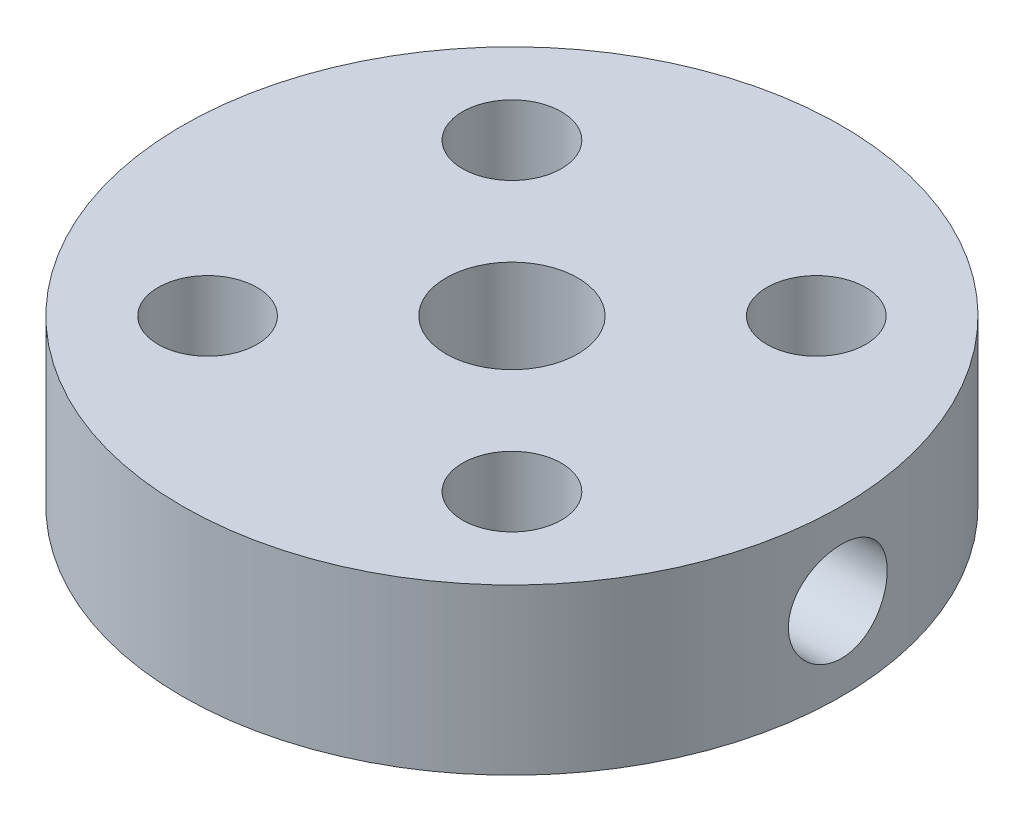
ISO-10303-21;
HEADER;
FILE_DESCRIPTION(('STEP AP214'),'2;1');
FILE_NAME('part.step','',(''),(''),'','','');
FILE_SCHEMA(('AUTOMOTIVE_DESIGN { 1 0 10303 214 1 1 1 1 }'));
ENDSEC;
DATA;
#1=APPLICATION_CONTEXT('core data for automotive mechanical design processes');
#2=APPLICATION_PROTOCOL_DEFINITION('international standard','automotive_design',2000,#1);
#3=PRODUCT_CONTEXT('',#1,'mechanical');
#4=PRODUCT('Part','Part','',(#3));
#5=PRODUCT_RELATED_PRODUCT_CATEGORY('part','',(#4));
#6=PRODUCT_DEFINITION_FORMATION('','',#4);
#7=PRODUCT_DEFINITION_CONTEXT('part definition',#1,'design');
#8=PRODUCT_DEFINITION('design','',#6,#7);
#9=PRODUCT_DEFINITION_SHAPE('','',#8);
#10=(LENGTH_UNIT() NAMED_UNIT(*) SI_UNIT(.MILLI.,.METRE.));
#11=(NAMED_UNIT(*) PLANE_ANGLE_UNIT() SI_UNIT($,.RADIAN.));
#12=(NAMED_UNIT(*) SI_UNIT($,.STERADIAN.) SOLID_ANGLE_UNIT());
#13=UNCERTAINTY_MEASURE_WITH_UNIT(LENGTH_MEASURE(1.E-05),#10,'distance_accuracy_value','');
#14=(GEOMETRIC_REPRESENTATION_CONTEXT(3) GLOBAL_UNCERTAINTY_ASSIGNED_CONTEXT((#13)) GLOBAL_UNIT_ASSIGNED_CONTEXT((#10,
#11,#12)) REPRESENTATION_CONTEXT('',''));
#15=CARTESIAN_POINT('',(0.,0.,0.));
#16=DIRECTION('',(0.,0.,1.));
#17=DIRECTION('',(1.,0.,0.));
#18=AXIS2_PLACEMENT_3D('',#15,#16,#17);
#19=CARTESIAN_POINT('',(-4.61740728114789,5.,4.61740728114842));
#20=DIRECTION('',(0.,-1.,0.));
#21=DIRECTION('',(0.,0.,-1.));
#22=AXIS2_PLACEMENT_3D('',#19,#20,#21);
#23=CYLINDRICAL_SURFACE('',#22,1.50000000000019);
#24=CARTESIAN_POINT('',(-4.61740728114789,5.,4.61740728114842));
#25=DIRECTION('',(0.,1.,0.));
#26=DIRECTION('',(0.,0.,1.));
#27=AXIS2_PLACEMENT_3D('',#24,#25,#26);
#28=CIRCLE('',#27,1.50000000000019);
#29=CARTESIAN_POINT('',(-4.61740728114789,5.,6.11740728114861));
#30=VERTEX_POINT('',#29);
#31=EDGE_CURVE('E52',#30,#30,#28,.T.);
#32=ORIENTED_EDGE('',*,*,#31,.T.);
#33=EDGE_LOOP('',(#32));
#34=FACE_BOUND('',#33,.T.);
#35=CARTESIAN_POINT('',(-4.61740728114789,0.,4.61740728114842));
#36=DIRECTION('',(0.,1.,0.));
#37=DIRECTION('',(0.,0.,1.));
#38=AXIS2_PLACEMENT_3D('',#35,#36,#37);
#39=CIRCLE('',#38,1.50000000000019);
#40=CARTESIAN_POINT('',(-4.61740728114789,0.,6.11740728114861));
#41=VERTEX_POINT('',#40);
#42=EDGE_CURVE('E74',#41,#41,#39,.T.);
#43=ORIENTED_EDGE('',*,*,#42,.F.);
#44=EDGE_LOOP('',(#43));
#45=FACE_BOUND('',#44,.T.);
#46=ADVANCED_FACE('F36',(#34,#45),#23,.F.);
#47=CARTESIAN_POINT('',(-4.61740728114816,5.,-4.61740728114789));
#48=DIRECTION('',(0.,-1.,0.));
#49=DIRECTION('',(0.,0.,-1.));
#50=AXIS2_PLACEMENT_3D('',#47,#48,#49);
#51=CYLINDRICAL_SURFACE('',#50,1.50000000000028);
#52=CARTESIAN_POINT('',(-4.61740728114816,5.,-4.61740728114789));
#53=DIRECTION('',(0.,1.,0.));
#54=DIRECTION('',(0.,0.,1.));
#55=AXIS2_PLACEMENT_3D('',#52,#53,#54);
#56=CIRCLE('',#55,1.50000000000028);
#57=CARTESIAN_POINT('',(-4.61740728114816,5.,-3.11740728114761));
#58=VERTEX_POINT('',#57);
#59=EDGE_CURVE('E57',#58,#58,#56,.T.);
#60=ORIENTED_EDGE('',*,*,#59,.T.);
#61=EDGE_LOOP('',(#60));
#62=FACE_BOUND('',#61,.T.);
#63=CARTESIAN_POINT('',(-4.61740728114816,0.,-4.61740728114789));
#64=DIRECTION('',(0.,1.,0.));
#65=DIRECTION('',(0.,0.,1.));
#66=AXIS2_PLACEMENT_3D('',#63,#64,#65);
#67=CIRCLE('',#66,1.50000000000028);
#68=CARTESIAN_POINT('',(-4.61740728114816,0.,-3.11740728114761));
#69=VERTEX_POINT('',#68);
#70=EDGE_CURVE('E71',#69,#69,#67,.T.);
#71=ORIENTED_EDGE('',*,*,#70,.F.);
#72=EDGE_LOOP('',(#71));
#73=FACE_BOUND('',#72,.T.);
#74=ADVANCED_FACE('F99',(#62,#73),#51,.F.);
#75=CARTESIAN_POINT('',(0.,5.,0.));
#76=DIRECTION('',(0.,-1.,0.));
#77=DIRECTION('',(0.,0.,-1.));
#78=AXIS2_PLACEMENT_3D('',#75,#76,#77);
#79=CYLINDRICAL_SURFACE('',#78,2.);
#80=CARTESIAN_POINT('',(1.32287565553229,2.5,-1.5));
#81=CARTESIAN_POINT('',(1.32289190044095,2.43000257657437,-1.49999219049448));
#82=CARTESIAN_POINT('',(1.32856366615416,2.35995416568808,-1.4950410907442));
#83=CARTESIAN_POINT('',(1.34990644032801,2.22267014379052,-1.47578333210409));
#84=CARTESIAN_POINT('',(1.3656072516867,2.15544355498049,-1.46144878565587));
#85=CARTESIAN_POINT('',(1.4037512791687,2.02642015326162,-1.42483838991846));
#86=CARTESIAN_POINT('',(1.42609848244814,1.96456122323754,-1.40267483444956));
#87=CARTESIAN_POINT('',(1.47486455031267,1.84565454555481,-1.35130655299364));
#88=CARTESIAN_POINT('',(1.50128292264932,1.78860621753078,-1.32210267801691));
#89=CARTESIAN_POINT('',(1.56177312961147,1.66788720368341,-1.25039909811055));
#90=CARTESIAN_POINT('',(1.59628904009787,1.60533206577352,-1.20639573950363));
#91=CARTESIAN_POINT('',(1.66521164096378,1.48747453375773,-1.10933596759308));
#92=CARTESIAN_POINT('',(1.69961809339876,1.43218303517973,-1.05626622282799));
#93=CARTESIAN_POINT('',(1.77262582436251,1.31914126134453,-0.929610192252516));
#94=CARTESIAN_POINT('',(1.81064921229758,1.26319403328014,-0.854047289142165));
#95=CARTESIAN_POINT('',(1.87882809751632,1.16537779171716,-0.691189714821942));
#96=CARTESIAN_POINT('',(1.90900204180106,1.12347570253119,-0.603923293836168));
#97=CARTESIAN_POINT('',(1.95034258990248,1.06679231409706,-0.447869023983647));
#98=CARTESIAN_POINT('',(1.96449710921006,1.04764290402153,-0.381446049692538));
#99=CARTESIAN_POINT('',(1.98605635937555,1.01860988400325,-0.245552609316544));
#100=CARTESIAN_POINT('',(1.99346695432364,1.00871822389326,-0.176084845995171));
#101=CARTESIAN_POINT('',(2.00091375578087,0.998778266137508,-0.0358650926220291));
#102=CARTESIAN_POINT('',(2.00093080057495,0.998755545623561,0.0348897591186376));
#103=CARTESIAN_POINT('',(1.99354206503066,1.00861793678029,0.175316156674035));
#104=CARTESIAN_POINT('',(1.98613456571337,1.01850534290814,0.244987447822225));
#105=CARTESIAN_POINT('',(1.96491377944411,1.04708105058987,0.37888919379265));
#106=CARTESIAN_POINT('',(1.9513285776568,1.06545632638708,0.443224268236294));
#107=CARTESIAN_POINT('',(1.91882278657017,1.10999564218224,0.567680485046395));
#108=CARTESIAN_POINT('',(1.89990103394193,1.13616138051316,0.627800705033634));
#109=CARTESIAN_POINT('',(1.85561045984504,1.19852961514532,0.749216921864728));
#110=CARTESIAN_POINT('',(1.82976540608097,1.23551209661876,0.809935384713597));
#111=CARTESIAN_POINT('',(1.77460702483739,1.31673370397051,0.924567250548282));
#112=CARTESIAN_POINT('',(1.74529074780454,1.3609790136999,0.978474784621219));
#113=CARTESIAN_POINT('',(1.6789376587236,1.46522334882094,1.08908204283329));
#114=CARTESIAN_POINT('',(1.64151655866368,1.5266092100264,1.14424493004784));
#115=CARTESIAN_POINT('',(1.5672595828377,1.65783458362194,1.24400875556228));
#116=CARTESIAN_POINT('',(1.53042399363524,1.72767809952506,1.28860466211477));
#117=CARTESIAN_POINT('',(1.46819425999159,1.86098187024563,1.358732064116));
#118=CARTESIAN_POINT('',(1.44197599789983,1.92298704530065,1.38628866868102));
#119=CARTESIAN_POINT('',(1.39536741257394,2.05206528141938,1.43319397108784));
#120=CARTESIAN_POINT('',(1.37496395320511,2.11912647969037,1.45256121808259));
#121=CARTESIAN_POINT('',(1.34640050620232,2.24368694399832,1.47902385350669));
#122=CARTESIAN_POINT('',(1.3366153955687,2.30044708211686,1.48779069496581));
#123=CARTESIAN_POINT('',(1.32435588438334,2.41535546617383,1.49871760619789));
#124=CARTESIAN_POINT('',(1.32187213058308,2.47350183990282,1.50088612873265));
#125=CARTESIAN_POINT('',(1.32462868790497,2.5894789917334,1.49845270115551));
#126=CARTESIAN_POINT('',(1.32987184207164,2.64730964580967,1.4938482589949));
#127=CARTESIAN_POINT('',(1.34721218775046,2.76107615244287,1.47822527271969));
#128=CARTESIAN_POINT('',(1.35932107727345,2.8170085979481,1.46719578056394));
#129=CARTESIAN_POINT('',(1.39427758287802,2.94633804493887,1.43413959562387));
#130=CARTESIAN_POINT('',(1.41944823697315,3.01843595391503,1.40954189769242));
#131=CARTESIAN_POINT('',(1.47537861079976,3.15630766364012,1.35088877838435));
#132=CARTESIAN_POINT('',(1.5061485847723,3.22206951729475,1.31681594335476));
#133=CARTESIAN_POINT('',(1.5710828237565,3.34934900804812,1.23869774116696));
#134=CARTESIAN_POINT('',(1.60532883846046,3.41063287621826,1.19434110060341));
#135=CARTESIAN_POINT('',(1.67347506272361,3.52600209636125,1.09682562914592));
#136=CARTESIAN_POINT('',(1.70737509574665,3.58008392798894,1.04366252194463));
#137=CARTESIAN_POINT('',(1.77960222623533,3.69127699162937,0.916234513829617));
#138=CARTESIAN_POINT('',(1.81728174165357,3.7464752388576,0.839896270946852));
#139=CARTESIAN_POINT('',(1.88453104769826,3.84262073345087,0.675551612651262));
#140=CARTESIAN_POINT('',(1.91411836052284,3.88359882458129,0.587571029974846));
#141=CARTESIAN_POINT('',(1.9541940640238,3.93843799144687,0.430755661496905));
#142=CARTESIAN_POINT('',(1.9677547802964,3.95675679327544,0.364250057327467));
#143=CARTESIAN_POINT('',(1.98810265589123,3.98412879630752,0.228364464964346));
#144=CARTESIAN_POINT('',(1.9948958710696,3.99319028154851,0.158987104561937));
#145=CARTESIAN_POINT('',(2.00113566717062,4.0015163909286,0.0191476059403936));
#146=CARTESIAN_POINT('',(2.00056500218907,4.00075801734824,-0.0513166925870926));
#147=CARTESIAN_POINT('',(1.9920880324381,3.98943900869876,-0.191009011030086));
#148=CARTESIAN_POINT('',(1.98417977344351,3.97887576229252,-0.260236696591293));
#149=CARTESIAN_POINT('',(1.96203400925195,3.94902508383276,-0.393521935254976));
#150=CARTESIAN_POINT('',(1.94798690792879,3.92999981867845,-0.457671236511446));
#151=CARTESIAN_POINT('',(1.91462720575136,3.88421193438106,-0.581661343097393));
#152=CARTESIAN_POINT('',(1.89531347862386,3.85744766016908,-0.641501223388819));
#153=CARTESIAN_POINT('',(1.8501764221064,3.79372206240403,-0.762547698766817));
#154=CARTESIAN_POINT('',(1.82386352707581,3.75594906864041,-0.823141236713423));
#155=CARTESIAN_POINT('',(1.76785506075716,3.67313355944579,-0.937414811724219));
#156=CARTESIAN_POINT('',(1.73815638795658,3.62808436271395,-0.991088412383378));
#157=CARTESIAN_POINT('',(1.67106353042106,3.5219946334392,-1.10112380660682));
#158=CARTESIAN_POINT('',(1.63330922504697,3.45955360056009,-1.15591691541996));
#159=CARTESIAN_POINT('',(1.55866082463332,3.32613192810012,-1.25475253429351));
#160=CARTESIAN_POINT('',(1.52176704921891,3.25514817396343,-1.29879110556729));
#161=CARTESIAN_POINT('',(1.46049601449284,3.12111674940969,-1.36695971301455));
#162=CARTESIAN_POINT('',(1.43513625007636,3.05966501729344,-1.39333526337999));
#163=CARTESIAN_POINT('',(1.39032564651232,2.93191708694412,-1.438053980286));
#164=CARTESIAN_POINT('',(1.37085915899696,2.86563430840454,-1.45641847678344));
#165=CARTESIAN_POINT('',(1.34532423383262,2.74921178040307,-1.47997057756381));
#166=CARTESIAN_POINT('',(1.33700130265679,2.70003292870953,-1.48744249026867));
#167=CARTESIAN_POINT('',(1.32577295392454,2.60057766696634,-1.49745839072448));
#168=CARTESIAN_POINT('',(1.32286398151145,2.55030199905627,-1.50000561211714));
#169=CARTESIAN_POINT('',(1.32287565553229,2.5,-1.5));
#170=B_SPLINE_CURVE_WITH_KNOTS('',3,(#80,#81,#82,#83,#84,#85,#86,#87,#88,#89,#90,#91,#92,#93,
#94,#95,#96,#97,#98,#99,#100,#101,#102,#103,#104,#105,#106,#107,#108,#109,#110,#111,#112,#113,
#114,#115,#116,#117,#118,#119,#120,#121,#122,#123,#124,#125,#126,#127,#128,#129,#130,#131,#132,
#133,#134,#135,#136,#137,#138,#139,#140,#141,#142,#143,#144,#145,#146,#147,#148,#149,#150,#151,
#152,#153,#154,#155,#156,#157,#158,#159,#160,#161,#162,#163,#164,#165,#166,#167,#168,#169),
.UNSPECIFIED.,.T.,.F.,(4,2,2,2,2,2,2,2,2,2,2,2,2,2,2,2,2,2,2,2,2,2,2,2,2,2,2,2,2,2,2,2,2,2,2,2,
2,2,2,2,2,2,2,2,4),(0.,0.20973177668449,0.420089722582994,0.627545385620138,0.834975984672344,
1.08585208691169,1.33710031031849,1.63964848103538,1.94147907444963,2.15227725277555,
2.36289195870711,2.57405250727807,2.78526195641288,2.9892375589505,3.19325766108669,
3.41936844116895,3.64567274887663,3.91649517204702,4.18744629647933,4.40499409477197,
4.62204646613006,4.79608005545901,4.96989060538193,5.14376512326213,5.31793678696019,
5.55730028202398,5.79710662639151,6.0454320909006,6.29387849446618,6.59652499511463,
6.89851088586565,7.10852896194427,7.31835893539181,7.52868041101044,7.73905791773945,
7.94332812691912,8.14764205379333,8.3751005248961,8.60276905744645,8.87547580578155,
9.14828228208531,9.36218279640836,9.57551025772699,9.72632812073766,9.87704692032409),.UNSPECIFIED.);
#171=CARTESIAN_POINT('',(1.32287565553229,2.5,-1.5));
#172=VERTEX_POINT('',#171);
#173=EDGE_CURVE('E65',#172,#172,#170,.T.);
#174=ORIENTED_EDGE('',*,*,#173,.F.);
#175=EDGE_LOOP('',(#174));
#176=FACE_BOUND('',#175,.T.);
#177=CARTESIAN_POINT('',(0.,5.,0.));
#178=DIRECTION('',(0.,1.,0.));
#179=DIRECTION('',(0.,0.,1.));
#180=AXIS2_PLACEMENT_3D('',#177,#178,#179);
#181=CIRCLE('',#180,2.);
#182=CARTESIAN_POINT('',(0.,5.,2.));
#183=VERTEX_POINT('',#182);
#184=EDGE_CURVE('E87',#183,#183,#181,.T.);
#185=ORIENTED_EDGE('',*,*,#184,.T.);
#186=EDGE_LOOP('',(#185));
#187=FACE_BOUND('',#186,.T.);
#188=CARTESIAN_POINT('',(0.,0.,0.));
#189=DIRECTION('',(0.,1.,0.));
#190=DIRECTION('',(0.,0.,1.));
#191=AXIS2_PLACEMENT_3D('',#188,#189,#190);
#192=CIRCLE('',#191,2.);
#193=CARTESIAN_POINT('',(0.,0.,2.));
#194=VERTEX_POINT('',#193);
#195=EDGE_CURVE('E68',#194,#194,#192,.T.);
#196=ORIENTED_EDGE('',*,*,#195,.F.);
#197=EDGE_LOOP('',(#196));
#198=FACE_BOUND('',#197,.T.);
#199=ADVANCED_FACE('F130',(#176,#187,#198),#79,.F.);
#200=CARTESIAN_POINT('',(4.61740728114815,5.,-4.61740728114816));
#201=DIRECTION('',(0.,-1.,0.));
#202=DIRECTION('',(0.,0.,-1.));
#203=AXIS2_PLACEMENT_3D('',#200,#201,#202);
#204=CYLINDRICAL_SURFACE('',#203,1.5);
#205=CARTESIAN_POINT('',(4.61740728114815,5.,-4.61740728114816));
#206=DIRECTION('',(0.,1.,0.));
#207=DIRECTION('',(0.,0.,1.));
#208=AXIS2_PLACEMENT_3D('',#205,#206,#207);
#209=CIRCLE('',#208,1.5);
#210=CARTESIAN_POINT('',(4.61740728114815,5.,-3.11740728114816));
#211=VERTEX_POINT('',#210);
#212=EDGE_CURVE('E82',#211,#211,#209,.T.);
#213=ORIENTED_EDGE('',*,*,#212,.T.);
#214=EDGE_LOOP('',(#213));
#215=FACE_BOUND('',#214,.T.);
#216=CARTESIAN_POINT('',(4.61740728114815,0.,-4.61740728114816));
#217=DIRECTION('',(0.,1.,0.));
#218=DIRECTION('',(0.,0.,1.));
#219=AXIS2_PLACEMENT_3D('',#216,#217,#218);
#220=CIRCLE('',#219,1.5);
#221=CARTESIAN_POINT('',(4.61740728114815,0.,-3.11740728114816));
#222=VERTEX_POINT('',#221);
#223=EDGE_CURVE('E64',#222,#222,#220,.T.);
#224=ORIENTED_EDGE('',*,*,#223,.F.);
#225=EDGE_LOOP('',(#224));
#226=FACE_BOUND('',#225,.T.);
#227=ADVANCED_FACE('F133',(#215,#226),#204,.F.);
#228=CARTESIAN_POINT('',(0.,5.,0.));
#229=DIRECTION('',(0.,-1.,0.));
#230=DIRECTION('',(0.,0.,-1.));
#231=AXIS2_PLACEMENT_3D('',#228,#229,#230);
#232=CYLINDRICAL_SURFACE('',#231,10.);
#233=CARTESIAN_POINT('',(9.8868599666426,2.5,-1.5));
#234=CARTESIAN_POINT('',(9.88686136668593,2.41625443071005,-1.49999654107284));
#235=CARTESIAN_POINT('',(9.88793551739101,2.33246024924929,-1.49296296388491));
#236=CARTESIAN_POINT('',(9.8921131480324,2.16721468511687,-1.46502196657001));
#237=CARTESIAN_POINT('',(9.8952186073143,2.08576566851999,-1.44410101402628));
#238=CARTESIAN_POINT('',(9.90309938986228,1.9276262445531,-1.38902526098084));
#239=CARTESIAN_POINT('',(9.90787343131536,1.85093223745784,-1.35488061681397));
#240=CARTESIAN_POINT('',(9.91855194113145,1.70437296922792,-1.27435063087792));
#241=CARTESIAN_POINT('',(9.92445625383668,1.6345067697857,-1.22796697429872));
#242=CARTESIAN_POINT('',(9.9367828924804,1.50301618324567,-1.12387902418559));
#243=CARTESIAN_POINT('',(9.94320862458058,1.44145438659326,-1.0660960558482));
#244=CARTESIAN_POINT('',(9.95582368169047,1.3288625143445,-0.941019605444376));
#245=CARTESIAN_POINT('',(9.96201299368615,1.27783301783301,-0.873725600786531));
#246=CARTESIAN_POINT('',(9.97349347428185,1.18752336830864,-0.731136358052747));
#247=CARTESIAN_POINT('',(9.97878018435569,1.14830084967754,-0.655804227365769));
#248=CARTESIAN_POINT('',(9.98782206746405,1.08308840119182,-0.499528850106976));
#249=CARTESIAN_POINT('',(9.99157732141945,1.05709777215711,-0.418585900270679));
#250=CARTESIAN_POINT('',(9.99710914797782,1.01927661146916,-0.254031123090571));
#251=CARTESIAN_POINT('',(9.99890035887344,1.00734127361284,-0.170443884389868));
#252=CARTESIAN_POINT('',(10.0003524476958,0.997644065175104,-0.00243520401948097));
#253=CARTESIAN_POINT('',(10.0000134440494,0.999881406680311,0.0819861910157443));
#254=CARTESIAN_POINT('',(9.99725499660796,1.01838333776243,0.248551718200518));
#255=CARTESIAN_POINT('',(9.99485227652479,1.03453517179148,0.330708691400005));
#256=CARTESIAN_POINT('',(9.98825500227851,1.08023060632258,0.491132829143135));
#257=CARTESIAN_POINT('',(9.98406040199739,1.10977455150144,0.56939989351348));
#258=CARTESIAN_POINT('',(9.97432193873206,1.18153099691709,0.720163780770315));
#259=CARTESIAN_POINT('',(9.96877303515638,1.22379096510874,0.792637672323595));
#260=CARTESIAN_POINT('',(9.95694438245421,1.31974519366999,0.929507907150176));
#261=CARTESIAN_POINT('',(9.95066458523184,1.37344020670687,0.993903718271733));
#262=CARTESIAN_POINT('',(9.93800158192627,1.49136844882659,1.11345448272264));
#263=CARTESIAN_POINT('',(9.93161796623257,1.55570012197011,1.16851232950946));
#264=CARTESIAN_POINT('',(9.91952704453523,1.69274107712373,1.26706599338813));
#265=CARTESIAN_POINT('',(9.91381974269649,1.76545041071992,1.31056173927999));
#266=CARTESIAN_POINT('',(9.90372775286856,1.91728396294064,1.38476964534605));
#267=CARTESIAN_POINT('',(9.89934409845291,1.99641313366239,1.41547182270081));
#268=CARTESIAN_POINT('',(9.8924140289906,2.15878525514739,1.46312336208879));
#269=CARTESIAN_POINT('',(9.88986748446299,2.24202791554675,1.48007369337326));
#270=CARTESIAN_POINT('',(9.88692451395027,2.40940008957749,1.49960720086655));
#271=CARTESIAN_POINT('',(9.88650748802574,2.49351318820153,1.50232803265052));
#272=CARTESIAN_POINT('',(9.88781607937153,2.66099419481734,1.49369057019819));
#273=CARTESIAN_POINT('',(9.88954163015778,2.74436212585076,1.48233271282302));
#274=CARTESIAN_POINT('',(9.89492202461453,2.90755981796563,1.44597702952766));
#275=CARTESIAN_POINT('',(9.89856716482858,2.9874052049416,1.42104778527821));
#276=CARTESIAN_POINT('',(9.90736801825768,3.14178409204861,1.35832831947086));
#277=CARTESIAN_POINT('',(9.91252380607176,3.2163173296282,1.32053746276389));
#278=CARTESIAN_POINT('',(9.92381355687063,3.35857326033504,1.23283677995323));
#279=CARTESIAN_POINT('',(9.92995459279988,3.42624044727982,1.18283784561766));
#280=CARTESIAN_POINT('',(9.94250159433355,3.55227285987381,1.07226416837201));
#281=CARTESIAN_POINT('',(9.94890757490292,3.61063755918115,1.01168882744679));
#282=CARTESIAN_POINT('',(9.96132705217387,3.71690260663358,0.881075619628182));
#283=CARTESIAN_POINT('',(9.96733683460423,3.76471172824248,0.810963126771956));
#284=CARTESIAN_POINT('',(9.97822905032016,3.84787290526264,0.66362208026368));
#285=CARTESIAN_POINT('',(9.98311151444563,3.88322530146503,0.586393721360438));
#286=CARTESIAN_POINT('',(9.99118269660795,3.94032374248803,0.427297995861146));
#287=CARTESIAN_POINT('',(9.99437761717899,3.96211966707836,0.345448858754301));
#288=CARTESIAN_POINT('',(9.99873976656896,3.99164787953747,0.179200815501192));
#289=CARTESIAN_POINT('',(9.99990712930802,3.99938109624914,0.0948020781305798));
#290=CARTESIAN_POINT('',(10.0000812905914,4.0005417045494,-0.0732645908608196));
#291=CARTESIAN_POINT('',(9.99910917023796,3.99410868087698,-0.156931570212053));
#292=CARTESIAN_POINT('',(9.99515610519141,3.96741861157924,-0.321979795323108));
#293=CARTESIAN_POINT('',(9.99217516692666,3.94716161019144,-0.403361048396514));
#294=CARTESIAN_POINT('',(9.98453786742463,3.89344812442976,-0.561489374379662));
#295=CARTESIAN_POINT('',(9.97988273316947,3.86000130486107,-0.638239793148784));
#296=CARTESIAN_POINT('',(9.96940834495499,3.78087251201686,-0.785061117896604));
#297=CARTESIAN_POINT('',(9.96358905320338,3.73519014151966,-0.85513180692071));
#298=CARTESIAN_POINT('',(9.95136510636178,3.63238230117083,-0.987312585191961));
#299=CARTESIAN_POINT('',(9.94495548425942,3.57515377418366,-1.04934206644638));
#300=CARTESIAN_POINT('',(9.93231001689001,3.45109492691953,-1.16296808390268));
#301=CARTESIAN_POINT('',(9.92607421276291,3.38426235617565,-1.21456216798984));
#302=CARTESIAN_POINT('',(9.91444484029116,3.24245101676747,-1.30611310822974));
#303=CARTESIAN_POINT('',(9.90905620156986,3.16742858297817,-1.34600294291209));
#304=CARTESIAN_POINT('',(9.89978909110724,3.0117032232367,-1.41255613872045));
#305=CARTESIAN_POINT('',(9.89590905307931,2.93100629214218,-1.43923322574898));
#306=CARTESIAN_POINT('',(9.89099485524825,2.79162256374352,-1.47254951890026));
#307=CARTESIAN_POINT('',(9.8894524938238,2.73379660307573,-1.4828276978042));
#308=CARTESIAN_POINT('',(9.88738456567012,2.61732170826565,-1.49655410576574));
#309=CARTESIAN_POINT('',(9.88685898576156,2.55867278480039,-1.50000242335076));
#310=CARTESIAN_POINT('',(9.8868599666426,2.5,-1.5));
#311=B_SPLINE_CURVE_WITH_KNOTS('',3,(#233,#234,#235,#236,#237,#238,#239,#240,#241,#242,#243,
#244,#245,#246,#247,#248,#249,#250,#251,#252,#253,#254,#255,#256,#257,#258,#259,#260,#261,#262,
#263,#264,#265,#266,#267,#268,#269,#270,#271,#272,#273,#274,#275,#276,#277,#278,#279,#280,#281,
#282,#283,#284,#285,#286,#287,#288,#289,#290,#291,#292,#293,#294,#295,#296,#297,#298,#299,#300,
#301,#302,#303,#304,#305,#306,#307,#308,#309,#310),.UNSPECIFIED.,.T.,.F.,(4,2,2,2,2,2,2,2,2,2,2,
2,2,2,2,2,2,2,2,2,2,2,2,2,2,2,2,2,2,2,2,2,2,2,2,2,2,2,4),(0.,0.251022251804867,
0.502289469561802,0.753364085335674,1.00440414866132,1.25724158649107,1.51009292207817,
1.76415922105782,2.018212093645,2.27035832534397,2.52249053939374,2.77259862515728,
3.02271314839401,3.27377316386453,3.52484970949272,3.77839544666269,4.0319427451435,
4.28568751773138,4.53941440444341,4.79068214603743,5.04194209099918,5.29194394807374,
5.54195815286117,5.79385486001302,6.04576581461802,6.29977537753516,6.55377799071854,
6.8068404089109,7.05988611170473,7.31044963622326,7.56101235892823,7.81139182257833,
8.06177941567106,8.31450950010969,8.56729890236862,8.82150878824931,9.07545403445564,
9.25132441891613,9.42719252376192),.UNSPECIFIED.);
#312=CARTESIAN_POINT('',(9.8868599666426,2.5,-1.5));
#313=VERTEX_POINT('',#312);
#314=EDGE_CURVE('E10',#313,#313,#311,.T.);
#315=ORIENTED_EDGE('',*,*,#314,.T.);
#316=EDGE_LOOP('',(#315));
#317=FACE_BOUND('',#316,.T.);
#318=CARTESIAN_POINT('',(0.,5.,0.));
#319=DIRECTION('',(0.,1.,0.));
#320=DIRECTION('',(0.,0.,1.));
#321=AXIS2_PLACEMENT_3D('',#318,#319,#320);
#322=CIRCLE('',#321,10.);
#323=CARTESIAN_POINT('',(0.,5.,10.));
#324=VERTEX_POINT('',#323);
#325=EDGE_CURVE('E78',#324,#324,#322,.T.);
#326=ORIENTED_EDGE('',*,*,#325,.F.);
#327=EDGE_LOOP('',(#326));
#328=FACE_BOUND('',#327,.T.);
#329=CARTESIAN_POINT('',(0.,0.,0.));
#330=DIRECTION('',(0.,1.,0.));
#331=DIRECTION('',(0.,0.,1.));
#332=AXIS2_PLACEMENT_3D('',#329,#330,#331);
#333=CIRCLE('',#332,10.);
#334=CARTESIAN_POINT('',(0.,0.,10.));
#335=VERTEX_POINT('',#334);
#336=EDGE_CURVE('E61',#335,#335,#333,.T.);
#337=ORIENTED_EDGE('',*,*,#336,.T.);
#338=EDGE_LOOP('',(#337));
#339=FACE_BOUND('',#338,.T.);
#340=ADVANCED_FACE('F38',(#317,#328,#339),#232,.T.);
#341=CARTESIAN_POINT('',(4.61740728114842,5.,4.61740728114815));
#342=DIRECTION('',(0.,-1.,0.));
#343=DIRECTION('',(0.,0.,-1.));
#344=AXIS2_PLACEMENT_3D('',#341,#342,#343);
#345=CYLINDRICAL_SURFACE('',#344,1.49999999999994);
#346=CARTESIAN_POINT('',(4.61740728114842,5.,4.61740728114815));
#347=DIRECTION('',(0.,1.,0.));
#348=DIRECTION('',(0.,0.,1.));
#349=AXIS2_PLACEMENT_3D('',#346,#347,#348);
#350=CIRCLE('',#349,1.49999999999994);
#351=CARTESIAN_POINT('',(4.61740728114842,5.,6.11740728114809));
#352=VERTEX_POINT('',#351);
#353=EDGE_CURVE('E48',#352,#352,#350,.T.);
#354=ORIENTED_EDGE('',*,*,#353,.T.);
#355=EDGE_LOOP('',(#354));
#356=FACE_BOUND('',#355,.T.);
#357=CARTESIAN_POINT('',(4.61740728114842,0.,4.61740728114815));
#358=DIRECTION('',(0.,1.,0.));
#359=DIRECTION('',(0.,0.,1.));
#360=AXIS2_PLACEMENT_3D('',#357,#358,#359);
#361=CIRCLE('',#360,1.49999999999994);
#362=CARTESIAN_POINT('',(4.61740728114842,0.,6.11740728114809));
#363=VERTEX_POINT('',#362);
#364=EDGE_CURVE('E76',#363,#363,#361,.T.);
#365=ORIENTED_EDGE('',*,*,#364,.F.);
#366=EDGE_LOOP('',(#365));
#367=FACE_BOUND('',#366,.T.);
#368=ADVANCED_FACE('F106',(#356,#367),#345,.F.);
#369=CARTESIAN_POINT('',(0.,5.,0.));
#370=DIRECTION('',(0.,1.,0.));
#371=DIRECTION('',(0.,0.,1.));
#372=AXIS2_PLACEMENT_3D('',#369,#370,#371);
#373=PLANE('',#372);
#374=ORIENTED_EDGE('',*,*,#325,.T.);
#375=EDGE_LOOP('',(#374));
#376=FACE_BOUND('',#375,.T.);
#377=ORIENTED_EDGE('',*,*,#212,.F.);
#378=EDGE_LOOP('',(#377));
#379=FACE_BOUND('',#378,.T.);
#380=ORIENTED_EDGE('',*,*,#184,.F.);
#381=EDGE_LOOP('',(#380));
#382=FACE_BOUND('',#381,.T.);
#383=ORIENTED_EDGE('',*,*,#59,.F.);
#384=EDGE_LOOP('',(#383));
#385=FACE_BOUND('',#384,.T.);
#386=ORIENTED_EDGE('',*,*,#31,.F.);
#387=EDGE_LOOP('',(#386));
#388=FACE_BOUND('',#387,.T.);
#389=ORIENTED_EDGE('',*,*,#353,.F.);
#390=EDGE_LOOP('',(#389));
#391=FACE_BOUND('',#390,.T.);
#392=ADVANCED_FACE('F102',(#376,#379,#382,#385,#388,#391),#373,.T.);
#393=CARTESIAN_POINT('',(0.,0.,0.));
#394=DIRECTION('',(0.,1.,0.));
#395=DIRECTION('',(0.,0.,1.));
#396=AXIS2_PLACEMENT_3D('',#393,#394,#395);
#397=PLANE('',#396);
#398=ORIENTED_EDGE('',*,*,#336,.F.);
#399=EDGE_LOOP('',(#398));
#400=FACE_BOUND('',#399,.T.);
#401=ORIENTED_EDGE('',*,*,#223,.T.);
#402=EDGE_LOOP('',(#401));
#403=FACE_BOUND('',#402,.T.);
#404=ORIENTED_EDGE('',*,*,#195,.T.);
#405=EDGE_LOOP('',(#404));
#406=FACE_BOUND('',#405,.T.);
#407=ORIENTED_EDGE('',*,*,#70,.T.);
#408=EDGE_LOOP('',(#407));
#409=FACE_BOUND('',#408,.T.);
#410=ORIENTED_EDGE('',*,*,#42,.T.);
#411=EDGE_LOOP('',(#410));
#412=FACE_BOUND('',#411,.T.);
#413=ORIENTED_EDGE('',*,*,#364,.T.);
#414=EDGE_LOOP('',(#413));
#415=FACE_BOUND('',#414,.T.);
#416=ADVANCED_FACE('F105',(#400,#403,#406,#409,#412,#415),#397,.F.);
#417=CARTESIAN_POINT('',(1.,2.5,0.));
#418=DIRECTION('',(1.,0.,0.));
#419=DIRECTION('',(0.,0.,-1.));
#420=AXIS2_PLACEMENT_3D('',#417,#418,#419);
#421=CYLINDRICAL_SURFACE('',#420,1.5);
#422=ORIENTED_EDGE('',*,*,#173,.T.);
#423=EDGE_LOOP('',(#422));
#424=FACE_BOUND('',#423,.T.);
#425=ORIENTED_EDGE('',*,*,#314,.F.);
#426=EDGE_LOOP('',(#425));
#427=FACE_BOUND('',#426,.T.);
#428=ADVANCED_FACE('F117',(#424,#427),#421,.F.);
#429=CLOSED_SHELL('',(#46,#74,#199,#227,#340,#368,#392,#416,#428));
#430=MANIFOLD_SOLID_BREP('B2',#429);
#431=ADVANCED_BREP_SHAPE_REPRESENTATION('',(#18,#430),#14);
#432=SHAPE_DEFINITION_REPRESENTATION(#9,#431);
ENDSEC;
END-ISO-10303-21;
